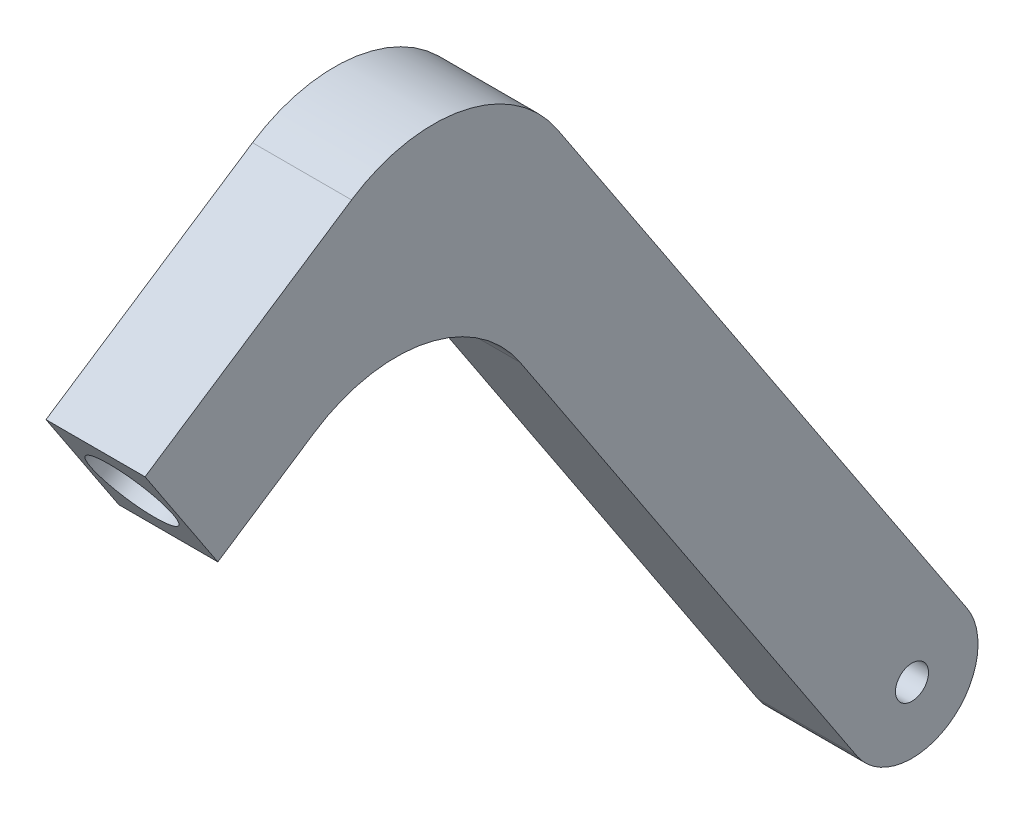
ISO-10303-21;
HEADER;
FILE_DESCRIPTION(('STEP AP214'),'2;1');
FILE_NAME('part.step','',(''),(''),'','','');
FILE_SCHEMA(('AUTOMOTIVE_DESIGN { 1 0 10303 214 1 1 1 1 }'));
ENDSEC;
DATA;
#1=APPLICATION_CONTEXT('core data for automotive mechanical design processes');
#2=APPLICATION_PROTOCOL_DEFINITION('international standard','automotive_design',2000,#1);
#3=PRODUCT_CONTEXT('',#1,'mechanical');
#4=PRODUCT('Part','Part','',(#3));
#5=PRODUCT_RELATED_PRODUCT_CATEGORY('part','',(#4));
#6=PRODUCT_DEFINITION_FORMATION('','',#4);
#7=PRODUCT_DEFINITION_CONTEXT('part definition',#1,'design');
#8=PRODUCT_DEFINITION('design','',#6,#7);
#9=PRODUCT_DEFINITION_SHAPE('','',#8);
#10=(LENGTH_UNIT() NAMED_UNIT(*) SI_UNIT(.MILLI.,.METRE.));
#11=(NAMED_UNIT(*) PLANE_ANGLE_UNIT() SI_UNIT($,.RADIAN.));
#12=(NAMED_UNIT(*) SI_UNIT($,.STERADIAN.) SOLID_ANGLE_UNIT());
#13=UNCERTAINTY_MEASURE_WITH_UNIT(LENGTH_MEASURE(1.E-05),#10,'distance_accuracy_value','');
#14=(GEOMETRIC_REPRESENTATION_CONTEXT(3) GLOBAL_UNCERTAINTY_ASSIGNED_CONTEXT((#13)) GLOBAL_UNIT_ASSIGNED_CONTEXT((#10,
#11,#12)) REPRESENTATION_CONTEXT('',''));
#15=CARTESIAN_POINT('',(0.,0.,0.));
#16=DIRECTION('',(0.,0.,1.));
#17=DIRECTION('',(1.,0.,0.));
#18=AXIS2_PLACEMENT_3D('',#15,#16,#17);
#19=CARTESIAN_POINT('',(30.,118.454021078494,156.264662961066));
#20=DIRECTION('',(-1.,0.,0.));
#21=DIRECTION('',(0.,0.,1.));
#22=AXIS2_PLACEMENT_3D('',#19,#20,#21);
#23=CYLINDRICAL_SURFACE('',#22,45.);
#24=CARTESIAN_POINT('',(0.,118.454021078494,156.264662961066));
#25=DIRECTION('',(1.,0.,0.));
#26=DIRECTION('',(0.,0.,-1.));
#27=AXIS2_PLACEMENT_3D('',#24,#25,#26);
#28=CIRCLE('',#27,45.);
#29=CARTESIAN_POINT('',(0.,143.276525824821,118.730102112182));
#30=VERTEX_POINT('',#29);
#31=CARTESIAN_POINT('',(0.,155.988581927378,181.087167707393));
#32=VERTEX_POINT('',#31);
#33=EDGE_CURVE('E131',#30,#32,#28,.T.);
#34=ORIENTED_EDGE('',*,*,#33,.F.);
#35=DIRECTION('',(-1.,0.,0.));
#36=VECTOR('',#35,1.);
#37=CARTESIAN_POINT('',(30.,143.276525824821,118.730102112182));
#38=LINE('',#37,#36);
#39=CARTESIAN_POINT('',(30.,143.276525824821,118.730102112182));
#40=VERTEX_POINT('',#39);
#41=EDGE_CURVE('E11',#40,#30,#38,.T.);
#42=ORIENTED_EDGE('',*,*,#41,.F.);
#43=CARTESIAN_POINT('',(30.,118.454021078494,156.264662961066));
#44=DIRECTION('',(1.,0.,0.));
#45=DIRECTION('',(0.,0.,-1.));
#46=AXIS2_PLACEMENT_3D('',#43,#44,#45);
#47=CIRCLE('',#46,45.);
#48=CARTESIAN_POINT('',(30.,155.988581927378,181.087167707393));
#49=VERTEX_POINT('',#48);
#50=EDGE_CURVE('E182',#40,#49,#47,.T.);
#51=ORIENTED_EDGE('',*,*,#50,.T.);
#52=DIRECTION('',(-1.,0.,0.));
#53=VECTOR('',#52,1.);
#54=CARTESIAN_POINT('',(30.,155.988581927378,181.087167707393));
#55=LINE('',#54,#53);
#56=EDGE_CURVE('E52',#49,#32,#55,.T.);
#57=ORIENTED_EDGE('',*,*,#56,.T.);
#58=EDGE_LOOP('',(#34,#42,#51,#57));
#59=FACE_BOUND('',#58,.T.);
#60=ADVANCED_FACE('F35',(#59),#23,.F.);
#61=CARTESIAN_POINT('',(30.,-11.0322243317009,16.6820270439484));
#62=DIRECTION('',(0.,-0.551611216585047,0.83410135219742));
#63=DIRECTION('',(0.,-0.83410135219742,-0.551611216585047));
#64=AXIS2_PLACEMENT_3D('',#61,#62,#63);
#65=PLANE('',#64);
#66=DIRECTION('',(0.,0.83410135219742,0.551611216585047));
#67=VECTOR('',#66,1.);
#68=CARTESIAN_POINT('',(0.,-11.0322243317009,16.6820270439484));
#69=LINE('',#68,#67);
#70=CARTESIAN_POINT('',(0.,-11.0322243317009,16.6820270439484));
#71=VERTEX_POINT('',#70);
#72=EDGE_CURVE('E134',#71,#30,#69,.T.);
#73=ORIENTED_EDGE('',*,*,#72,.F.);
#74=DIRECTION('',(-1.,0.,0.));
#75=VECTOR('',#74,1.);
#76=CARTESIAN_POINT('',(30.,-11.0322243317009,16.6820270439484));
#77=LINE('',#76,#75);
#78=CARTESIAN_POINT('',(30.,-11.0322243317009,16.6820270439484));
#79=VERTEX_POINT('',#78);
#80=EDGE_CURVE('E44',#79,#71,#77,.T.);
#81=ORIENTED_EDGE('',*,*,#80,.F.);
#82=DIRECTION('',(0.,0.83410135219742,0.551611216585047));
#83=VECTOR('',#82,1.);
#84=CARTESIAN_POINT('',(30.,-11.0322243317009,16.6820270439484));
#85=LINE('',#84,#83);
#86=EDGE_CURVE('E180',#79,#40,#85,.T.);
#87=ORIENTED_EDGE('',*,*,#86,.T.);
#88=ORIENTED_EDGE('',*,*,#41,.T.);
#89=EDGE_LOOP('',(#73,#81,#87,#88));
#90=FACE_BOUND('',#89,.T.);
#91=ADVANCED_FACE('F170',(#90),#65,.T.);
#92=CARTESIAN_POINT('',(30.,0.,0.));
#93=DIRECTION('',(-1.,0.,0.));
#94=DIRECTION('',(0.,0.,1.));
#95=AXIS2_PLACEMENT_3D('',#92,#93,#94);
#96=CYLINDRICAL_SURFACE('',#95,20.);
#97=CARTESIAN_POINT('',(0.,0.,0.));
#98=DIRECTION('',(1.,0.,0.));
#99=DIRECTION('',(0.,0.,-1.));
#100=AXIS2_PLACEMENT_3D('',#97,#98,#99);
#101=CIRCLE('',#100,20.);
#102=CARTESIAN_POINT('',(0.,11.0322243317009,-16.6820270439484));
#103=VERTEX_POINT('',#102);
#104=EDGE_CURVE('E137',#103,#71,#101,.F.);
#105=ORIENTED_EDGE('',*,*,#104,.F.);
#106=DIRECTION('',(-1.,0.,0.));
#107=VECTOR('',#106,1.);
#108=CARTESIAN_POINT('',(30.,11.0322243317009,-16.6820270439484));
#109=LINE('',#108,#107);
#110=CARTESIAN_POINT('',(30.,11.0322243317009,-16.6820270439484));
#111=VERTEX_POINT('',#110);
#112=EDGE_CURVE('E159',#111,#103,#109,.T.);
#113=ORIENTED_EDGE('',*,*,#112,.F.);
#114=CARTESIAN_POINT('',(30.,0.,0.));
#115=DIRECTION('',(1.,0.,0.));
#116=DIRECTION('',(0.,0.,-1.));
#117=AXIS2_PLACEMENT_3D('',#114,#115,#116);
#118=CIRCLE('',#117,20.);
#119=EDGE_CURVE('E166',#111,#79,#118,.F.);
#120=ORIENTED_EDGE('',*,*,#119,.T.);
#121=ORIENTED_EDGE('',*,*,#80,.T.);
#122=EDGE_LOOP('',(#105,#113,#120,#121));
#123=FACE_BOUND('',#122,.T.);
#124=ADVANCED_FACE('F164',(#123),#96,.T.);
#125=CARTESIAN_POINT('',(30.,11.0322243317009,-16.6820270439484));
#126=DIRECTION('',(0.,-0.551611216585047,0.83410135219742));
#127=DIRECTION('',(0.,-0.83410135219742,-0.551611216585047));
#128=AXIS2_PLACEMENT_3D('',#125,#126,#127);
#129=PLANE('',#128);
#130=DIRECTION('',(0.,0.83410135219742,0.551611216585047));
#131=VECTOR('',#130,1.);
#132=CARTESIAN_POINT('',(0.,11.0322243317009,-16.6820270439484));
#133=LINE('',#132,#131);
#134=CARTESIAN_POINT('',(0.,198.70502857612,107.430496687687));
#135=VERTEX_POINT('',#134);
#136=EDGE_CURVE('E140',#103,#135,#133,.T.);
#137=ORIENTED_EDGE('',*,*,#136,.T.);
#138=DIRECTION('',(-1.,0.,0.));
#139=VECTOR('',#138,1.);
#140=CARTESIAN_POINT('',(30.,198.70502857612,107.430496687687));
#141=LINE('',#140,#139);
#142=CARTESIAN_POINT('',(30.,198.70502857612,107.430496687687));
#143=VERTEX_POINT('',#142);
#144=EDGE_CURVE('E156',#143,#135,#141,.T.);
#145=ORIENTED_EDGE('',*,*,#144,.F.);
#146=DIRECTION('',(0.,0.83410135219742,0.551611216585047));
#147=VECTOR('',#146,1.);
#148=CARTESIAN_POINT('',(30.,11.0322243317009,-16.6820270439484));
#149=LINE('',#148,#147);
#150=EDGE_CURVE('E178',#111,#143,#149,.T.);
#151=ORIENTED_EDGE('',*,*,#150,.F.);
#152=ORIENTED_EDGE('',*,*,#112,.T.);
#153=EDGE_LOOP('',(#137,#145,#151,#152));
#154=FACE_BOUND('',#153,.T.);
#155=ADVANCED_FACE('F176',(#154),#129,.F.);
#156=CARTESIAN_POINT('',(30.,173.882523829793,144.965057536571));
#157=DIRECTION('',(-1.,0.,0.));
#158=DIRECTION('',(0.,0.,1.));
#159=AXIS2_PLACEMENT_3D('',#156,#157,#158);
#160=CYLINDRICAL_SURFACE('',#159,45.);
#161=CARTESIAN_POINT('',(0.,173.882523829793,144.965057536571));
#162=DIRECTION('',(1.,0.,0.));
#163=DIRECTION('',(0.,0.,-1.));
#164=AXIS2_PLACEMENT_3D('',#161,#162,#163);
#165=CIRCLE('',#164,45.);
#166=CARTESIAN_POINT('',(0.,211.417084678677,169.787562282899));
#167=VERTEX_POINT('',#166);
#168=EDGE_CURVE('E143',#135,#167,#165,.T.);
#169=ORIENTED_EDGE('',*,*,#168,.T.);
#170=DIRECTION('',(-1.,0.,0.));
#171=VECTOR('',#170,1.);
#172=CARTESIAN_POINT('',(30.,211.417084678677,169.787562282899));
#173=LINE('',#172,#171);
#174=CARTESIAN_POINT('',(30.,211.417084678677,169.787562282899));
#175=VERTEX_POINT('',#174);
#176=EDGE_CURVE('E120',#175,#167,#173,.T.);
#177=ORIENTED_EDGE('',*,*,#176,.F.);
#178=CARTESIAN_POINT('',(30.,173.882523829793,144.965057536571));
#179=DIRECTION('',(1.,0.,0.));
#180=DIRECTION('',(0.,0.,-1.));
#181=AXIS2_PLACEMENT_3D('',#178,#179,#180);
#182=CIRCLE('',#181,45.);
#183=EDGE_CURVE('E109',#143,#175,#182,.T.);
#184=ORIENTED_EDGE('',*,*,#183,.F.);
#185=ORIENTED_EDGE('',*,*,#144,.T.);
#186=EDGE_LOOP('',(#169,#177,#184,#185));
#187=FACE_BOUND('',#186,.T.);
#188=ADVANCED_FACE('F210',(#187),#160,.T.);
#189=CARTESIAN_POINT('',(30.,225.207365093303,148.935028477964));
#190=DIRECTION('',(0.,-0.834101352197418,-0.551611216585051));
#191=DIRECTION('',(0.,0.551611216585051,-0.834101352197418));
#192=AXIS2_PLACEMENT_3D('',#189,#190,#191);
#193=PLANE('',#192);
#194=DIRECTION('',(0.,-0.551611216585051,0.834101352197418));
#195=VECTOR('',#194,1.);
#196=CARTESIAN_POINT('',(0.,225.207365093303,148.935028477964));
#197=LINE('',#196,#195);
#198=CARTESIAN_POINT('',(0.,170.046243434798,232.345163697705));
#199=VERTEX_POINT('',#198);
#200=EDGE_CURVE('E117',#167,#199,#197,.T.);
#201=ORIENTED_EDGE('',*,*,#200,.T.);
#202=DIRECTION('',(-1.,0.,0.));
#203=VECTOR('',#202,1.);
#204=CARTESIAN_POINT('',(30.,170.046243434798,232.345163697705));
#205=LINE('',#204,#203);
#206=CARTESIAN_POINT('',(30.,170.046243434798,232.345163697705));
#207=VERTEX_POINT('',#206);
#208=EDGE_CURVE('E115',#207,#199,#205,.T.);
#209=ORIENTED_EDGE('',*,*,#208,.F.);
#210=DIRECTION('',(0.,-0.551611216585051,0.834101352197418));
#211=VECTOR('',#210,1.);
#212=CARTESIAN_POINT('',(30.,225.207365093303,148.935028477964));
#213=LINE('',#212,#211);
#214=EDGE_CURVE('E102',#175,#207,#213,.T.);
#215=ORIENTED_EDGE('',*,*,#214,.F.);
#216=ORIENTED_EDGE('',*,*,#176,.T.);
#217=EDGE_LOOP('',(#201,#209,#215,#216));
#218=FACE_BOUND('',#217,.T.);
#219=ADVANCED_FACE('F116',(#218),#193,.F.);
#220=CARTESIAN_POINT('',(30.,-55.1611216585045,83.4101352197411));
#221=DIRECTION('',(0.,-0.55161121658505,0.834101352197418));
#222=DIRECTION('',(0.,-0.834101352197418,-0.55161121658505));
#223=AXIS2_PLACEMENT_3D('',#220,#221,#222);
#224=PLANE('',#223);
#225=CARTESIAN_POINT('',(15.,153.36421639085,221.312939366004));
#226=DIRECTION('',(0.,-0.551611216585051,0.834101352197418));
#227=DIRECTION('',(0.,-0.834101352197418,-0.551611216585051));
#228=AXIS2_PLACEMENT_3D('',#225,#226,#227);
#229=CIRCLE('',#228,12.5);
#230=CARTESIAN_POINT('',(15.,142.937949488382,214.417799158691));
#231=VERTEX_POINT('',#230);
#232=EDGE_CURVE('E188',#231,#231,#229,.T.);
#233=ORIENTED_EDGE('',*,*,#232,.F.);
#234=EDGE_LOOP('',(#233));
#235=FACE_BOUND('',#234,.T.);
#236=DIRECTION('',(0.,0.834101352197418,0.55161121658505));
#237=VECTOR('',#236,1.);
#238=CARTESIAN_POINT('',(0.,-55.1611216585045,83.4101352197411));
#239=LINE('',#238,#237);
#240=CARTESIAN_POINT('',(0.,136.682189346902,210.280715034303));
#241=VERTEX_POINT('',#240);
#242=EDGE_CURVE('E147',#241,#199,#239,.T.);
#243=ORIENTED_EDGE('',*,*,#242,.F.);
#244=DIRECTION('',(-1.,0.,0.));
#245=VECTOR('',#244,1.);
#246=CARTESIAN_POINT('',(30.,136.682189346902,210.280715034303));
#247=LINE('',#246,#245);
#248=CARTESIAN_POINT('',(30.,136.682189346902,210.280715034303));
#249=VERTEX_POINT('',#248);
#250=EDGE_CURVE('E77',#249,#241,#247,.T.);
#251=ORIENTED_EDGE('',*,*,#250,.F.);
#252=DIRECTION('',(0.,0.834101352197418,0.55161121658505));
#253=VECTOR('',#252,1.);
#254=CARTESIAN_POINT('',(30.,-55.1611216585045,83.4101352197411));
#255=LINE('',#254,#253);
#256=EDGE_CURVE('E107',#249,#207,#255,.T.);
#257=ORIENTED_EDGE('',*,*,#256,.T.);
#258=ORIENTED_EDGE('',*,*,#208,.T.);
#259=EDGE_LOOP('',(#243,#251,#257,#258));
#260=FACE_BOUND('',#259,.T.);
#261=ADVANCED_FACE('F122',(#235,#260),#224,.T.);
#262=CARTESIAN_POINT('',(30.,0.,0.));
#263=DIRECTION('',(-1.,0.,0.));
#264=DIRECTION('',(0.,0.,1.));
#265=AXIS2_PLACEMENT_3D('',#262,#263,#264);
#266=CYLINDRICAL_SURFACE('',#265,5.);
#267=CARTESIAN_POINT('',(30.,0.,0.));
#268=DIRECTION('',(1.,0.,0.));
#269=DIRECTION('',(0.,0.,-1.));
#270=AXIS2_PLACEMENT_3D('',#267,#268,#269);
#271=CIRCLE('',#270,5.);
#272=CARTESIAN_POINT('',(30.,0.,-5.));
#273=VERTEX_POINT('',#272);
#274=EDGE_CURVE('E152',#273,#273,#271,.T.);
#275=ORIENTED_EDGE('',*,*,#274,.T.);
#276=EDGE_LOOP('',(#275));
#277=FACE_BOUND('',#276,.T.);
#278=CARTESIAN_POINT('',(0.,0.,0.));
#279=DIRECTION('',(1.,0.,0.));
#280=DIRECTION('',(0.,0.,-1.));
#281=AXIS2_PLACEMENT_3D('',#278,#279,#280);
#282=CIRCLE('',#281,5.);
#283=CARTESIAN_POINT('',(0.,0.,-5.));
#284=VERTEX_POINT('',#283);
#285=EDGE_CURVE('E128',#284,#284,#282,.T.);
#286=ORIENTED_EDGE('',*,*,#285,.F.);
#287=EDGE_LOOP('',(#286));
#288=FACE_BOUND('',#287,.T.);
#289=ADVANCED_FACE('F37',(#277,#288),#266,.F.);
#290=CARTESIAN_POINT('',(30.,191.843311005406,126.870579814562));
#291=DIRECTION('',(0.,-0.834101352197418,-0.55161121658505));
#292=DIRECTION('',(0.,0.55161121658505,-0.834101352197418));
#293=AXIS2_PLACEMENT_3D('',#290,#291,#292);
#294=PLANE('',#293);
#295=DIRECTION('',(0.,-0.55161121658505,0.834101352197418));
#296=VECTOR('',#295,1.);
#297=CARTESIAN_POINT('',(0.,191.843311005406,126.870579814562));
#298=LINE('',#297,#296);
#299=EDGE_CURVE('E149',#32,#241,#298,.T.);
#300=ORIENTED_EDGE('',*,*,#299,.F.);
#301=ORIENTED_EDGE('',*,*,#56,.F.);
#302=DIRECTION('',(0.,-0.55161121658505,0.834101352197418));
#303=VECTOR('',#302,1.);
#304=CARTESIAN_POINT('',(30.,191.843311005406,126.870579814562));
#305=LINE('',#304,#303);
#306=EDGE_CURVE('E123',#49,#249,#305,.T.);
#307=ORIENTED_EDGE('',*,*,#306,.T.);
#308=ORIENTED_EDGE('',*,*,#250,.T.);
#309=EDGE_LOOP('',(#300,#301,#307,#308));
#310=FACE_BOUND('',#309,.T.);
#311=ADVANCED_FACE('F208',(#310),#294,.T.);
#312=CARTESIAN_POINT('',(30.,0.,0.));
#313=DIRECTION('',(1.,0.,0.));
#314=DIRECTION('',(0.,0.,-1.));
#315=AXIS2_PLACEMENT_3D('',#312,#313,#314);
#316=PLANE('',#315);
#317=ORIENTED_EDGE('',*,*,#274,.F.);
#318=EDGE_LOOP('',(#317));
#319=FACE_BOUND('',#318,.T.);
#320=ORIENTED_EDGE('',*,*,#50,.F.);
#321=ORIENTED_EDGE('',*,*,#86,.F.);
#322=ORIENTED_EDGE('',*,*,#119,.F.);
#323=ORIENTED_EDGE('',*,*,#150,.T.);
#324=ORIENTED_EDGE('',*,*,#183,.T.);
#325=ORIENTED_EDGE('',*,*,#214,.T.);
#326=ORIENTED_EDGE('',*,*,#256,.F.);
#327=ORIENTED_EDGE('',*,*,#306,.F.);
#328=EDGE_LOOP('',(#320,#321,#322,#323,#324,#325,#326,#327));
#329=FACE_BOUND('',#328,.T.);
#330=ADVANCED_FACE('F104',(#319,#329),#316,.T.);
#331=CARTESIAN_POINT('',(0.,0.,0.));
#332=DIRECTION('',(1.,0.,0.));
#333=DIRECTION('',(0.,0.,-1.));
#334=AXIS2_PLACEMENT_3D('',#331,#332,#333);
#335=PLANE('',#334);
#336=ORIENTED_EDGE('',*,*,#285,.T.);
#337=EDGE_LOOP('',(#336));
#338=FACE_BOUND('',#337,.T.);
#339=ORIENTED_EDGE('',*,*,#33,.T.);
#340=ORIENTED_EDGE('',*,*,#299,.T.);
#341=ORIENTED_EDGE('',*,*,#242,.T.);
#342=ORIENTED_EDGE('',*,*,#200,.F.);
#343=ORIENTED_EDGE('',*,*,#168,.F.);
#344=ORIENTED_EDGE('',*,*,#136,.F.);
#345=ORIENTED_EDGE('',*,*,#104,.T.);
#346=ORIENTED_EDGE('',*,*,#72,.T.);
#347=EDGE_LOOP('',(#339,#340,#341,#342,#343,#344,#345,#346));
#348=FACE_BOUND('',#347,.T.);
#349=ADVANCED_FACE('F173',(#338,#348),#335,.F.);
#350=CARTESIAN_POINT('',(15.,164.396440722551,204.630912322055));
#351=DIRECTION('',(0.,-0.55161121658505,0.834101352197418));
#352=DIRECTION('',(0.,-0.834101352197418,-0.55161121658505));
#353=AXIS2_PLACEMENT_3D('',#350,#351,#352);
#354=CYLINDRICAL_SURFACE('',#353,12.5);
#355=CARTESIAN_POINT('',(15.,164.396440722551,204.630912322055));
#356=DIRECTION('',(0.,-0.551611216585051,0.834101352197418));
#357=DIRECTION('',(0.,-0.834101352197418,-0.551611216585051));
#358=AXIS2_PLACEMENT_3D('',#355,#356,#357);
#359=CIRCLE('',#358,12.5);
#360=CARTESIAN_POINT('',(15.,153.970173820083,197.735772114742));
#361=VERTEX_POINT('',#360);
#362=EDGE_CURVE('E132',#361,#361,#359,.T.);
#363=ORIENTED_EDGE('',*,*,#362,.F.);
#364=EDGE_LOOP('',(#363));
#365=FACE_BOUND('',#364,.T.);
#366=ORIENTED_EDGE('',*,*,#232,.T.);
#367=EDGE_LOOP('',(#366));
#368=FACE_BOUND('',#367,.T.);
#369=ADVANCED_FACE('F196',(#365,#368),#354,.F.);
#370=CARTESIAN_POINT('',(15.,164.396440722551,204.630912322055));
#371=DIRECTION('',(0.,-0.551611216585051,0.834101352197418));
#372=DIRECTION('',(0.,-0.834101352197418,-0.551611216585051));
#373=AXIS2_PLACEMENT_3D('',#370,#371,#372);
#374=PLANE('',#373);
#375=ORIENTED_EDGE('',*,*,#362,.T.);
#376=EDGE_LOOP('',(#375));
#377=FACE_BOUND('',#376,.T.);
#378=ADVANCED_FACE('F194',(#377),#374,.T.);
#379=CLOSED_SHELL('',(#60,#91,#124,#155,#188,#219,#261,#289,#311,#330,#349,#369,#378));
#380=MANIFOLD_SOLID_BREP('B2',#379);
#381=ADVANCED_BREP_SHAPE_REPRESENTATION('',(#18,#380),#14);
#382=SHAPE_DEFINITION_REPRESENTATION(#9,#381);
ENDSEC;
END-ISO-10303-21;
